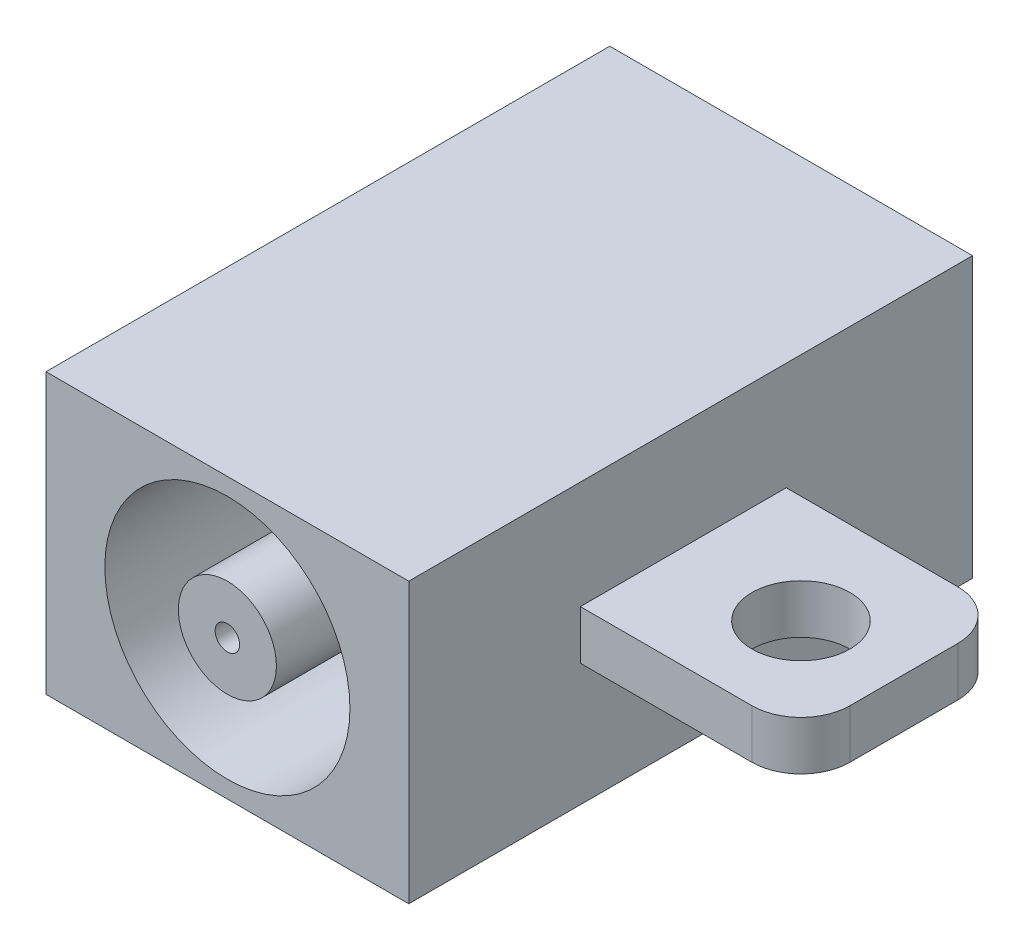
ISO-10303-21;
HEADER;
FILE_DESCRIPTION(('STEP AP214'),'2;1');
FILE_NAME('part.step','',(''),(''),'','','');
FILE_SCHEMA(('AUTOMOTIVE_DESIGN { 1 0 10303 214 1 1 1 1 }'));
ENDSEC;
DATA;
#1=APPLICATION_CONTEXT('core data for automotive mechanical design processes');
#2=APPLICATION_PROTOCOL_DEFINITION('international standard','automotive_design',2000,#1);
#3=PRODUCT_CONTEXT('',#1,'mechanical');
#4=PRODUCT('Part','Part','',(#3));
#5=PRODUCT_RELATED_PRODUCT_CATEGORY('part','',(#4));
#6=PRODUCT_DEFINITION_FORMATION('','',#4);
#7=PRODUCT_DEFINITION_CONTEXT('part definition',#1,'design');
#8=PRODUCT_DEFINITION('design','',#6,#7);
#9=PRODUCT_DEFINITION_SHAPE('','',#8);
#10=(LENGTH_UNIT() NAMED_UNIT(*) SI_UNIT(.MILLI.,.METRE.));
#11=(NAMED_UNIT(*) PLANE_ANGLE_UNIT() SI_UNIT($,.RADIAN.));
#12=(NAMED_UNIT(*) SI_UNIT($,.STERADIAN.) SOLID_ANGLE_UNIT());
#13=UNCERTAINTY_MEASURE_WITH_UNIT(LENGTH_MEASURE(1.E-05),#10,'distance_accuracy_value','');
#14=(GEOMETRIC_REPRESENTATION_CONTEXT(3) GLOBAL_UNCERTAINTY_ASSIGNED_CONTEXT((#13)) GLOBAL_UNIT_ASSIGNED_CONTEXT((#10,
#11,#12)) REPRESENTATION_CONTEXT('',''));
#15=CARTESIAN_POINT('',(0.,0.,0.));
#16=DIRECTION('',(0.,0.,1.));
#17=DIRECTION('',(1.,0.,0.));
#18=AXIS2_PLACEMENT_3D('',#15,#16,#17);
#19=CARTESIAN_POINT('',(7.4,5.7,0.));
#20=DIRECTION('',(-1.,0.,0.));
#21=DIRECTION('',(0.,0.,1.));
#22=AXIS2_PLACEMENT_3D('',#19,#20,#21);
#23=PLANE('',#22);
#24=DIRECTION('',(0.,0.,-1.));
#25=VECTOR('',#24,1.);
#26=CARTESIAN_POINT('',(7.4,0.,0.));
#27=LINE('',#26,#25);
#28=CARTESIAN_POINT('',(7.4,0.,0.));
#29=VERTEX_POINT('',#28);
#30=CARTESIAN_POINT('',(7.4,0.,-11.5));
#31=VERTEX_POINT('',#30);
#32=EDGE_CURVE('E208',#29,#31,#27,.T.);
#33=ORIENTED_EDGE('',*,*,#32,.T.);
#34=DIRECTION('',(0.,-1.,0.));
#35=VECTOR('',#34,1.);
#36=CARTESIAN_POINT('',(7.4,5.7,-11.5));
#37=LINE('',#36,#35);
#38=CARTESIAN_POINT('',(7.4,5.7,-11.5));
#39=VERTEX_POINT('',#38);
#40=EDGE_CURVE('E216',#39,#31,#37,.T.);
#41=ORIENTED_EDGE('',*,*,#40,.F.);
#42=DIRECTION('',(0.,0.,-1.));
#43=VECTOR('',#42,1.);
#44=CARTESIAN_POINT('',(7.4,5.7,0.));
#45=LINE('',#44,#43);
#46=CARTESIAN_POINT('',(7.4,5.7,0.));
#47=VERTEX_POINT('',#46);
#48=EDGE_CURVE('E195',#47,#39,#45,.T.);
#49=ORIENTED_EDGE('',*,*,#48,.F.);
#50=DIRECTION('',(0.,-1.,0.));
#51=VECTOR('',#50,1.);
#52=CARTESIAN_POINT('',(7.4,5.7,0.));
#53=LINE('',#52,#51);
#54=EDGE_CURVE('E220',#47,#29,#53,.T.);
#55=ORIENTED_EDGE('',*,*,#54,.T.);
#56=EDGE_LOOP('',(#33,#41,#49,#55));
#57=FACE_BOUND('',#56,.T.);
#58=DIRECTION('',(0.,-1.,0.));
#59=VECTOR('',#58,1.);
#60=CARTESIAN_POINT('',(7.4,3.5,-3.5));
#61=LINE('',#60,#59);
#62=CARTESIAN_POINT('',(7.4,3.5,-3.5));
#63=VERTEX_POINT('',#62);
#64=CARTESIAN_POINT('',(7.4,2.5,-3.5));
#65=VERTEX_POINT('',#64);
#66=EDGE_CURVE('E148',#63,#65,#61,.T.);
#67=ORIENTED_EDGE('',*,*,#66,.F.);
#68=DIRECTION('',(0.,0.,1.));
#69=VECTOR('',#68,1.);
#70=CARTESIAN_POINT('',(7.4,3.5,-3.5));
#71=LINE('',#70,#69);
#72=CARTESIAN_POINT('',(7.4,3.5,-7.7));
#73=VERTEX_POINT('',#72);
#74=EDGE_CURVE('E143',#73,#63,#71,.T.);
#75=ORIENTED_EDGE('',*,*,#74,.F.);
#76=DIRECTION('',(0.,1.,0.));
#77=VECTOR('',#76,1.);
#78=CARTESIAN_POINT('',(7.4,3.5,-7.7));
#79=LINE('',#78,#77);
#80=CARTESIAN_POINT('',(7.4,2.5,-7.7));
#81=VERTEX_POINT('',#80);
#82=EDGE_CURVE('E129',#81,#73,#79,.T.);
#83=ORIENTED_EDGE('',*,*,#82,.F.);
#84=DIRECTION('',(0.,0.,-1.));
#85=VECTOR('',#84,1.);
#86=CARTESIAN_POINT('',(7.4,2.5,-3.5));
#87=LINE('',#86,#85);
#88=EDGE_CURVE('E140',#65,#81,#87,.T.);
#89=ORIENTED_EDGE('',*,*,#88,.F.);
#90=EDGE_LOOP('',(#67,#75,#83,#89));
#91=FACE_BOUND('',#90,.T.);
#92=ADVANCED_FACE('F50',(#57,#91),#23,.F.);
#93=CARTESIAN_POINT('',(0.,5.7,0.));
#94=DIRECTION('',(1.,0.,0.));
#95=DIRECTION('',(0.,0.,-1.));
#96=AXIS2_PLACEMENT_3D('',#93,#94,#95);
#97=PLANE('',#96);
#98=DIRECTION('',(0.,0.,1.));
#99=VECTOR('',#98,1.);
#100=CARTESIAN_POINT('',(0.,0.,0.));
#101=LINE('',#100,#99);
#102=CARTESIAN_POINT('',(0.,0.,-11.5));
#103=VERTEX_POINT('',#102);
#104=CARTESIAN_POINT('',(0.,0.,0.));
#105=VERTEX_POINT('',#104);
#106=EDGE_CURVE('E183',#103,#105,#101,.T.);
#107=ORIENTED_EDGE('',*,*,#106,.T.);
#108=DIRECTION('',(0.,-1.,0.));
#109=VECTOR('',#108,1.);
#110=CARTESIAN_POINT('',(0.,5.7,0.));
#111=LINE('',#110,#109);
#112=CARTESIAN_POINT('',(0.,5.7,0.));
#113=VERTEX_POINT('',#112);
#114=EDGE_CURVE('E224',#113,#105,#111,.T.);
#115=ORIENTED_EDGE('',*,*,#114,.F.);
#116=DIRECTION('',(0.,0.,1.));
#117=VECTOR('',#116,1.);
#118=CARTESIAN_POINT('',(0.,5.7,0.));
#119=LINE('',#118,#117);
#120=CARTESIAN_POINT('',(0.,5.7,-11.5));
#121=VERTEX_POINT('',#120);
#122=EDGE_CURVE('E187',#121,#113,#119,.T.);
#123=ORIENTED_EDGE('',*,*,#122,.F.);
#124=DIRECTION('',(0.,-1.,0.));
#125=VECTOR('',#124,1.);
#126=CARTESIAN_POINT('',(0.,5.7,-11.5));
#127=LINE('',#126,#125);
#128=EDGE_CURVE('E201',#121,#103,#127,.T.);
#129=ORIENTED_EDGE('',*,*,#128,.T.);
#130=EDGE_LOOP('',(#107,#115,#123,#129));
#131=FACE_BOUND('',#130,.T.);
#132=ADVANCED_FACE('F289',(#131),#97,.F.);
#133=CARTESIAN_POINT('',(0.,5.7,0.));
#134=DIRECTION('',(0.,0.,-1.));
#135=DIRECTION('',(-1.,0.,0.));
#136=AXIS2_PLACEMENT_3D('',#133,#134,#135);
#137=PLANE('',#136);
#138=CARTESIAN_POINT('',(3.7,2.85,0.));
#139=DIRECTION('',(0.,0.,1.));
#140=DIRECTION('',(1.,0.,0.));
#141=AXIS2_PLACEMENT_3D('',#138,#139,#140);
#142=CIRCLE('',#141,2.5);
#143=CARTESIAN_POINT('',(6.2,2.85,0.));
#144=VERTEX_POINT('',#143);
#145=EDGE_CURVE('E178',#144,#144,#142,.T.);
#146=ORIENTED_EDGE('',*,*,#145,.F.);
#147=EDGE_LOOP('',(#146));
#148=FACE_BOUND('',#147,.T.);
#149=DIRECTION('',(1.,0.,0.));
#150=VECTOR('',#149,1.);
#151=CARTESIAN_POINT('',(0.,0.,0.));
#152=LINE('',#151,#150);
#153=EDGE_CURVE('E205',#105,#29,#152,.T.);
#154=ORIENTED_EDGE('',*,*,#153,.T.);
#155=ORIENTED_EDGE('',*,*,#54,.F.);
#156=DIRECTION('',(1.,0.,0.));
#157=VECTOR('',#156,1.);
#158=CARTESIAN_POINT('',(0.,5.7,0.));
#159=LINE('',#158,#157);
#160=EDGE_CURVE('E191',#113,#47,#159,.T.);
#161=ORIENTED_EDGE('',*,*,#160,.F.);
#162=ORIENTED_EDGE('',*,*,#114,.T.);
#163=EDGE_LOOP('',(#154,#155,#161,#162));
#164=FACE_BOUND('',#163,.T.);
#165=ADVANCED_FACE('F295',(#148,#164),#137,.F.);
#166=CARTESIAN_POINT('',(0.,5.7,-11.5));
#167=DIRECTION('',(0.,0.,1.));
#168=DIRECTION('',(1.,0.,0.));
#169=AXIS2_PLACEMENT_3D('',#166,#167,#168);
#170=PLANE('',#169);
#171=DIRECTION('',(-1.,0.,0.));
#172=VECTOR('',#171,1.);
#173=CARTESIAN_POINT('',(0.,0.,-11.5));
#174=LINE('',#173,#172);
#175=EDGE_CURVE('E192',#31,#103,#174,.T.);
#176=ORIENTED_EDGE('',*,*,#175,.T.);
#177=ORIENTED_EDGE('',*,*,#128,.F.);
#178=DIRECTION('',(-1.,0.,0.));
#179=VECTOR('',#178,1.);
#180=CARTESIAN_POINT('',(0.,5.7,-11.5));
#181=LINE('',#180,#179);
#182=EDGE_CURVE('E198',#39,#121,#181,.T.);
#183=ORIENTED_EDGE('',*,*,#182,.F.);
#184=ORIENTED_EDGE('',*,*,#40,.T.);
#185=EDGE_LOOP('',(#176,#177,#183,#184));
#186=FACE_BOUND('',#185,.T.);
#187=ADVANCED_FACE('F300',(#186),#170,.F.);
#188=CARTESIAN_POINT('',(0.,5.7,0.));
#189=DIRECTION('',(0.,-1.,0.));
#190=DIRECTION('',(0.,0.,-1.));
#191=AXIS2_PLACEMENT_3D('',#188,#189,#190);
#192=PLANE('',#191);
#193=ORIENTED_EDGE('',*,*,#122,.T.);
#194=ORIENTED_EDGE('',*,*,#160,.T.);
#195=ORIENTED_EDGE('',*,*,#48,.T.);
#196=ORIENTED_EDGE('',*,*,#182,.T.);
#197=EDGE_LOOP('',(#193,#194,#195,#196));
#198=FACE_BOUND('',#197,.T.);
#199=ADVANCED_FACE('F348',(#198),#192,.F.);
#200=CARTESIAN_POINT('',(0.,0.,0.));
#201=DIRECTION('',(0.,-1.,0.));
#202=DIRECTION('',(0.,0.,-1.));
#203=AXIS2_PLACEMENT_3D('',#200,#201,#202);
#204=PLANE('',#203);
#205=ORIENTED_EDGE('',*,*,#106,.F.);
#206=ORIENTED_EDGE('',*,*,#175,.F.);
#207=ORIENTED_EDGE('',*,*,#32,.F.);
#208=ORIENTED_EDGE('',*,*,#153,.F.);
#209=EDGE_LOOP('',(#205,#206,#207,#208));
#210=FACE_BOUND('',#209,.T.);
#211=ADVANCED_FACE('F346',(#210),#204,.T.);
#212=CARTESIAN_POINT('',(3.7,2.85,-5.5));
#213=DIRECTION('',(0.,0.,1.));
#214=DIRECTION('',(1.,0.,0.));
#215=AXIS2_PLACEMENT_3D('',#212,#213,#214);
#216=CYLINDRICAL_SURFACE('',#215,2.5);
#217=CARTESIAN_POINT('',(3.7,2.85,-5.5));
#218=DIRECTION('',(0.,0.,1.));
#219=DIRECTION('',(1.,0.,0.));
#220=AXIS2_PLACEMENT_3D('',#217,#218,#219);
#221=CIRCLE('',#220,2.5);
#222=CARTESIAN_POINT('',(6.2,2.85,-5.5));
#223=VERTEX_POINT('',#222);
#224=EDGE_CURVE('E179',#223,#223,#221,.T.);
#225=ORIENTED_EDGE('',*,*,#224,.F.);
#226=EDGE_LOOP('',(#225));
#227=FACE_BOUND('',#226,.T.);
#228=ORIENTED_EDGE('',*,*,#145,.T.);
#229=EDGE_LOOP('',(#228));
#230=FACE_BOUND('',#229,.T.);
#231=ADVANCED_FACE('F342',(#227,#230),#216,.F.);
#232=CARTESIAN_POINT('',(3.7,2.85,-5.5));
#233=DIRECTION('',(0.,0.,1.));
#234=DIRECTION('',(1.,0.,0.));
#235=AXIS2_PLACEMENT_3D('',#232,#233,#234);
#236=PLANE('',#235);
#237=CARTESIAN_POINT('',(3.7,2.85,-5.5));
#238=DIRECTION('',(0.,0.,1.));
#239=DIRECTION('',(1.,0.,0.));
#240=AXIS2_PLACEMENT_3D('',#237,#238,#239);
#241=CIRCLE('',#240,0.999999999999999);
#242=CARTESIAN_POINT('',(4.7,2.85,-5.5));
#243=VERTEX_POINT('',#242);
#244=EDGE_CURVE('E228',#243,#243,#241,.T.);
#245=ORIENTED_EDGE('',*,*,#244,.F.);
#246=EDGE_LOOP('',(#245));
#247=FACE_BOUND('',#246,.T.);
#248=ORIENTED_EDGE('',*,*,#224,.T.);
#249=EDGE_LOOP('',(#248));
#250=FACE_BOUND('',#249,.T.);
#251=ADVANCED_FACE('F338',(#247,#250),#236,.T.);
#252=CARTESIAN_POINT('',(3.7,2.85,-5.5));
#253=DIRECTION('',(0.,0.,1.));
#254=DIRECTION('',(1.,0.,0.));
#255=AXIS2_PLACEMENT_3D('',#252,#253,#254);
#256=CYLINDRICAL_SURFACE('',#255,0.999999999999999);
#257=ORIENTED_EDGE('',*,*,#244,.T.);
#258=EDGE_LOOP('',(#257));
#259=FACE_BOUND('',#258,.T.);
#260=CARTESIAN_POINT('',(3.7,2.85,0.));
#261=DIRECTION('',(0.,0.,1.));
#262=DIRECTION('',(1.,0.,0.));
#263=AXIS2_PLACEMENT_3D('',#260,#261,#262);
#264=CIRCLE('',#263,0.999999999999999);
#265=CARTESIAN_POINT('',(4.7,2.85,0.));
#266=VERTEX_POINT('',#265);
#267=EDGE_CURVE('E171',#266,#266,#264,.T.);
#268=ORIENTED_EDGE('',*,*,#267,.F.);
#269=EDGE_LOOP('',(#268));
#270=FACE_BOUND('',#269,.T.);
#271=ADVANCED_FACE('F334',(#259,#270),#256,.T.);
#272=CARTESIAN_POINT('',(3.7,2.85,0.));
#273=DIRECTION('',(0.,0.,1.));
#274=DIRECTION('',(1.,0.,0.));
#275=AXIS2_PLACEMENT_3D('',#272,#273,#274);
#276=PLANE('',#275);
#277=CARTESIAN_POINT('',(3.7,2.85,0.));
#278=DIRECTION('',(0.,0.,1.));
#279=DIRECTION('',(1.,0.,0.));
#280=AXIS2_PLACEMENT_3D('',#277,#278,#279);
#281=CIRCLE('',#280,0.25);
#282=CARTESIAN_POINT('',(3.95,2.85,0.));
#283=VERTEX_POINT('',#282);
#284=EDGE_CURVE('E166',#283,#283,#281,.T.);
#285=ORIENTED_EDGE('',*,*,#284,.F.);
#286=EDGE_LOOP('',(#285));
#287=FACE_BOUND('',#286,.T.);
#288=ORIENTED_EDGE('',*,*,#267,.T.);
#289=EDGE_LOOP('',(#288));
#290=FACE_BOUND('',#289,.T.);
#291=ADVANCED_FACE('F330',(#287,#290),#276,.T.);
#292=CARTESIAN_POINT('',(3.7,2.85,-5.5));
#293=DIRECTION('',(0.,0.,1.));
#294=DIRECTION('',(1.,0.,0.));
#295=AXIS2_PLACEMENT_3D('',#292,#293,#294);
#296=CYLINDRICAL_SURFACE('',#295,0.25);
#297=CARTESIAN_POINT('',(3.7,2.85,-5.5));
#298=DIRECTION('',(0.,0.,1.));
#299=DIRECTION('',(1.,0.,0.));
#300=AXIS2_PLACEMENT_3D('',#297,#298,#299);
#301=CIRCLE('',#300,0.25);
#302=CARTESIAN_POINT('',(3.95,2.85,-5.5));
#303=VERTEX_POINT('',#302);
#304=EDGE_CURVE('E167',#303,#303,#301,.T.);
#305=ORIENTED_EDGE('',*,*,#304,.F.);
#306=EDGE_LOOP('',(#305));
#307=FACE_BOUND('',#306,.T.);
#308=ORIENTED_EDGE('',*,*,#284,.T.);
#309=EDGE_LOOP('',(#308));
#310=FACE_BOUND('',#309,.T.);
#311=ADVANCED_FACE('F324',(#307,#310),#296,.F.);
#312=CARTESIAN_POINT('',(3.7,2.85,-5.5));
#313=DIRECTION('',(0.,0.,1.));
#314=DIRECTION('',(1.,0.,0.));
#315=AXIS2_PLACEMENT_3D('',#312,#313,#314);
#316=PLANE('',#315);
#317=ORIENTED_EDGE('',*,*,#304,.T.);
#318=EDGE_LOOP('',(#317));
#319=FACE_BOUND('',#318,.T.);
#320=ADVANCED_FACE('F316',(#319),#316,.T.);
#321=CARTESIAN_POINT('',(11.9,3.5,-3.5));
#322=DIRECTION('',(0.,0.,-1.));
#323=DIRECTION('',(-1.,0.,0.));
#324=AXIS2_PLACEMENT_3D('',#321,#322,#323);
#325=PLANE('',#324);
#326=DIRECTION('',(-1.,0.,0.));
#327=VECTOR('',#326,1.);
#328=CARTESIAN_POINT('',(11.9,2.5,-3.5));
#329=LINE('',#328,#327);
#330=CARTESIAN_POINT('',(10.9,2.5,-3.5));
#331=VERTEX_POINT('',#330);
#332=EDGE_CURVE('E133',#331,#65,#329,.T.);
#333=ORIENTED_EDGE('',*,*,#332,.F.);
#334=DIRECTION('',(0.,-1.,0.));
#335=VECTOR('',#334,1.);
#336=CARTESIAN_POINT('',(10.9,3.5,-3.5));
#337=LINE('',#336,#335);
#338=CARTESIAN_POINT('',(10.9,3.5,-3.5));
#339=VERTEX_POINT('',#338);
#340=EDGE_CURVE('E11',#331,#339,#337,.F.);
#341=ORIENTED_EDGE('',*,*,#340,.T.);
#342=DIRECTION('',(-1.,0.,0.));
#343=VECTOR('',#342,1.);
#344=CARTESIAN_POINT('',(11.9,3.5,-3.5));
#345=LINE('',#344,#343);
#346=EDGE_CURVE('E158',#339,#63,#345,.T.);
#347=ORIENTED_EDGE('',*,*,#346,.T.);
#348=ORIENTED_EDGE('',*,*,#66,.T.);
#349=EDGE_LOOP('',(#333,#341,#347,#348));
#350=FACE_BOUND('',#349,.T.);
#351=ADVANCED_FACE('F314',(#350),#325,.F.);
#352=CARTESIAN_POINT('',(11.9,2.5,-3.5));
#353=DIRECTION('',(0.,1.,0.));
#354=DIRECTION('',(0.,0.,1.));
#355=AXIS2_PLACEMENT_3D('',#352,#353,#354);
#356=PLANE('',#355);
#357=CARTESIAN_POINT('',(9.9,2.5,-5.5));
#358=DIRECTION('',(0.,1.,0.));
#359=DIRECTION('',(0.,0.,1.));
#360=AXIS2_PLACEMENT_3D('',#357,#358,#359);
#361=CIRCLE('',#360,1.);
#362=CARTESIAN_POINT('',(9.9,2.5,-4.5));
#363=VERTEX_POINT('',#362);
#364=EDGE_CURVE('E151',#363,#363,#361,.F.);
#365=ORIENTED_EDGE('',*,*,#364,.F.);
#366=EDGE_LOOP('',(#365));
#367=FACE_BOUND('',#366,.T.);
#368=DIRECTION('',(-1.,0.,0.));
#369=VECTOR('',#368,1.);
#370=CARTESIAN_POINT('',(11.9,2.5,-7.7));
#371=LINE('',#370,#369);
#372=CARTESIAN_POINT('',(10.9,2.5,-7.7));
#373=VERTEX_POINT('',#372);
#374=EDGE_CURVE('E126',#373,#81,#371,.T.);
#375=ORIENTED_EDGE('',*,*,#374,.F.);
#376=CARTESIAN_POINT('',(10.9,2.5,-6.7));
#377=DIRECTION('',(0.,1.,0.));
#378=DIRECTION('',(0.,0.,1.));
#379=AXIS2_PLACEMENT_3D('',#376,#377,#378);
#380=CIRCLE('',#379,1.);
#381=CARTESIAN_POINT('',(11.9,2.5,-6.7));
#382=VERTEX_POINT('',#381);
#383=EDGE_CURVE('E59',#373,#382,#380,.F.);
#384=ORIENTED_EDGE('',*,*,#383,.T.);
#385=DIRECTION('',(0.,0.,-1.));
#386=VECTOR('',#385,1.);
#387=CARTESIAN_POINT('',(11.9,2.5,-3.5));
#388=LINE('',#387,#386);
#389=CARTESIAN_POINT('',(11.9,2.5,-4.5));
#390=VERTEX_POINT('',#389);
#391=EDGE_CURVE('E157',#390,#382,#388,.T.);
#392=ORIENTED_EDGE('',*,*,#391,.F.);
#393=CARTESIAN_POINT('',(10.9,2.5,-4.5));
#394=DIRECTION('',(0.,1.,0.));
#395=DIRECTION('',(0.,0.,1.));
#396=AXIS2_PLACEMENT_3D('',#393,#394,#395);
#397=CIRCLE('',#396,1.);
#398=EDGE_CURVE('E66',#390,#331,#397,.F.);
#399=ORIENTED_EDGE('',*,*,#398,.T.);
#400=ORIENTED_EDGE('',*,*,#332,.T.);
#401=ORIENTED_EDGE('',*,*,#88,.T.);
#402=EDGE_LOOP('',(#375,#384,#392,#399,#400,#401));
#403=FACE_BOUND('',#402,.T.);
#404=ADVANCED_FACE('F146',(#367,#403),#356,.F.);
#405=CARTESIAN_POINT('',(11.9,3.5,-7.7));
#406=DIRECTION('',(0.,0.,1.));
#407=DIRECTION('',(0.,-1.,0.));
#408=AXIS2_PLACEMENT_3D('',#405,#406,#407);
#409=PLANE('',#408);
#410=DIRECTION('',(-1.,0.,0.));
#411=VECTOR('',#410,1.);
#412=CARTESIAN_POINT('',(11.9,3.5,-7.7));
#413=LINE('',#412,#411);
#414=CARTESIAN_POINT('',(10.9,3.5,-7.7));
#415=VERTEX_POINT('',#414);
#416=EDGE_CURVE('E134',#415,#73,#413,.T.);
#417=ORIENTED_EDGE('',*,*,#416,.F.);
#418=DIRECTION('',(0.,1.,0.));
#419=VECTOR('',#418,1.);
#420=CARTESIAN_POINT('',(10.9,2.5,-7.7));
#421=LINE('',#420,#419);
#422=EDGE_CURVE('E74',#415,#373,#421,.F.);
#423=ORIENTED_EDGE('',*,*,#422,.T.);
#424=ORIENTED_EDGE('',*,*,#374,.T.);
#425=ORIENTED_EDGE('',*,*,#82,.T.);
#426=EDGE_LOOP('',(#417,#423,#424,#425));
#427=FACE_BOUND('',#426,.T.);
#428=ADVANCED_FACE('F128',(#427),#409,.F.);
#429=CARTESIAN_POINT('',(11.9,3.5,-3.5));
#430=DIRECTION('',(0.,-1.,0.));
#431=DIRECTION('',(0.,0.,-1.));
#432=AXIS2_PLACEMENT_3D('',#429,#430,#431);
#433=PLANE('',#432);
#434=CARTESIAN_POINT('',(9.9,3.5,-5.5));
#435=DIRECTION('',(0.,1.,0.));
#436=DIRECTION('',(0.,0.,1.));
#437=AXIS2_PLACEMENT_3D('',#434,#435,#436);
#438=CIRCLE('',#437,1.);
#439=CARTESIAN_POINT('',(9.9,3.5,-4.5));
#440=VERTEX_POINT('',#439);
#441=EDGE_CURVE('E270',#440,#440,#438,.T.);
#442=ORIENTED_EDGE('',*,*,#441,.F.);
#443=EDGE_LOOP('',(#442));
#444=FACE_BOUND('',#443,.T.);
#445=DIRECTION('',(0.,0.,1.));
#446=VECTOR('',#445,1.);
#447=CARTESIAN_POINT('',(11.9,3.5,-3.5));
#448=LINE('',#447,#446);
#449=CARTESIAN_POINT('',(11.9,3.5,-6.7));
#450=VERTEX_POINT('',#449);
#451=CARTESIAN_POINT('',(11.9,3.5,-4.5));
#452=VERTEX_POINT('',#451);
#453=EDGE_CURVE('E161',#450,#452,#448,.T.);
#454=ORIENTED_EDGE('',*,*,#453,.F.);
#455=CARTESIAN_POINT('',(10.9,3.5,-6.7));
#456=DIRECTION('',(0.,-1.,0.));
#457=DIRECTION('',(0.,0.,-1.));
#458=AXIS2_PLACEMENT_3D('',#455,#456,#457);
#459=CIRCLE('',#458,1.);
#460=EDGE_CURVE('E243',#450,#415,#459,.F.);
#461=ORIENTED_EDGE('',*,*,#460,.T.);
#462=ORIENTED_EDGE('',*,*,#416,.T.);
#463=ORIENTED_EDGE('',*,*,#74,.T.);
#464=ORIENTED_EDGE('',*,*,#346,.F.);
#465=CARTESIAN_POINT('',(10.9,3.5,-4.5));
#466=DIRECTION('',(0.,-1.,0.));
#467=DIRECTION('',(0.,0.,-1.));
#468=AXIS2_PLACEMENT_3D('',#465,#466,#467);
#469=CIRCLE('',#468,1.);
#470=EDGE_CURVE('E240',#339,#452,#469,.F.);
#471=ORIENTED_EDGE('',*,*,#470,.T.);
#472=EDGE_LOOP('',(#454,#461,#462,#463,#464,#471));
#473=FACE_BOUND('',#472,.T.);
#474=ADVANCED_FACE('F262',(#444,#473),#433,.F.);
#475=CARTESIAN_POINT('',(11.9,0.,0.));
#476=DIRECTION('',(1.,0.,0.));
#477=DIRECTION('',(0.,0.,-1.));
#478=AXIS2_PLACEMENT_3D('',#475,#476,#477);
#479=PLANE('',#478);
#480=ORIENTED_EDGE('',*,*,#391,.T.);
#481=DIRECTION('',(0.,1.,0.));
#482=VECTOR('',#481,1.);
#483=CARTESIAN_POINT('',(11.9,3.5,-6.7));
#484=LINE('',#483,#482);
#485=EDGE_CURVE('E236',#382,#450,#484,.T.);
#486=ORIENTED_EDGE('',*,*,#485,.T.);
#487=ORIENTED_EDGE('',*,*,#453,.T.);
#488=DIRECTION('',(0.,-1.,0.));
#489=VECTOR('',#488,1.);
#490=CARTESIAN_POINT('',(11.9,2.5,-4.5));
#491=LINE('',#490,#489);
#492=EDGE_CURVE('E232',#452,#390,#491,.T.);
#493=ORIENTED_EDGE('',*,*,#492,.T.);
#494=EDGE_LOOP('',(#480,#486,#487,#493));
#495=FACE_BOUND('',#494,.T.);
#496=ADVANCED_FACE('F254',(#495),#479,.T.);
#497=CARTESIAN_POINT('',(10.9,0.,-6.7));
#498=DIRECTION('',(0.,-1.,0.));
#499=DIRECTION('',(0.,0.,-1.));
#500=AXIS2_PLACEMENT_3D('',#497,#498,#499);
#501=CYLINDRICAL_SURFACE('',#500,1.);
#502=ORIENTED_EDGE('',*,*,#383,.F.);
#503=ORIENTED_EDGE('',*,*,#422,.F.);
#504=ORIENTED_EDGE('',*,*,#460,.F.);
#505=ORIENTED_EDGE('',*,*,#485,.F.);
#506=EDGE_LOOP('',(#502,#503,#504,#505));
#507=FACE_BOUND('',#506,.T.);
#508=ADVANCED_FACE('F260',(#507),#501,.T.);
#509=CARTESIAN_POINT('',(10.9,0.,-4.5));
#510=DIRECTION('',(0.,1.,0.));
#511=DIRECTION('',(0.,0.,1.));
#512=AXIS2_PLACEMENT_3D('',#509,#510,#511);
#513=CYLINDRICAL_SURFACE('',#512,1.);
#514=ORIENTED_EDGE('',*,*,#470,.F.);
#515=ORIENTED_EDGE('',*,*,#340,.F.);
#516=ORIENTED_EDGE('',*,*,#398,.F.);
#517=ORIENTED_EDGE('',*,*,#492,.F.);
#518=EDGE_LOOP('',(#514,#515,#516,#517));
#519=FACE_BOUND('',#518,.T.);
#520=ADVANCED_FACE('F52',(#519),#513,.T.);
#521=CARTESIAN_POINT('',(9.9,-0.00100000000000013,-5.5));
#522=DIRECTION('',(0.,1.,0.));
#523=DIRECTION('',(0.,0.,1.));
#524=AXIS2_PLACEMENT_3D('',#521,#522,#523);
#525=CYLINDRICAL_SURFACE('',#524,1.);
#526=ORIENTED_EDGE('',*,*,#441,.T.);
#527=EDGE_LOOP('',(#526));
#528=FACE_BOUND('',#527,.T.);
#529=ORIENTED_EDGE('',*,*,#364,.T.);
#530=EDGE_LOOP('',(#529));
#531=FACE_BOUND('',#530,.T.);
#532=ADVANCED_FACE('F275',(#528,#531),#525,.F.);
#533=CLOSED_SHELL('',(#92,#132,#165,#187,#199,#211,#231,#251,#271,#291,#311,#320,#351,#404,#428,
#474,#496,#508,#520,#532));
#534=MANIFOLD_SOLID_BREP('B2',#533);
#535=ADVANCED_BREP_SHAPE_REPRESENTATION('',(#18,#534),#14);
#536=SHAPE_DEFINITION_REPRESENTATION(#9,#535);
ENDSEC;
END-ISO-10303-21;
